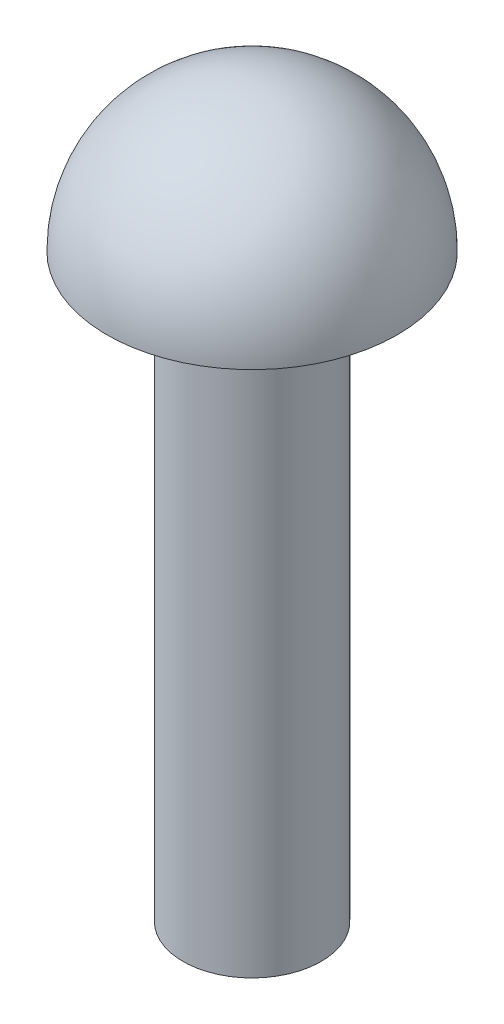
ISO-10303-21;
HEADER;
FILE_DESCRIPTION(('STEP AP214'),'2;1');
FILE_NAME('part.step','',(''),(''),'','','');
FILE_SCHEMA(('AUTOMOTIVE_DESIGN { 1 0 10303 214 1 1 1 1 }'));
ENDSEC;
DATA;
#1=APPLICATION_CONTEXT('core data for automotive mechanical design processes');
#2=APPLICATION_PROTOCOL_DEFINITION('international standard','automotive_design',2000,#1);
#3=PRODUCT_CONTEXT('',#1,'mechanical');
#4=PRODUCT('Part','Part','',(#3));
#5=PRODUCT_RELATED_PRODUCT_CATEGORY('part','',(#4));
#6=PRODUCT_DEFINITION_FORMATION('','',#4);
#7=PRODUCT_DEFINITION_CONTEXT('part definition',#1,'design');
#8=PRODUCT_DEFINITION('design','',#6,#7);
#9=PRODUCT_DEFINITION_SHAPE('','',#8);
#10=(LENGTH_UNIT() NAMED_UNIT(*) SI_UNIT(.MILLI.,.METRE.));
#11=(NAMED_UNIT(*) PLANE_ANGLE_UNIT() SI_UNIT($,.RADIAN.));
#12=(NAMED_UNIT(*) SI_UNIT($,.STERADIAN.) SOLID_ANGLE_UNIT());
#13=UNCERTAINTY_MEASURE_WITH_UNIT(LENGTH_MEASURE(1.E-05),#10,'distance_accuracy_value','');
#14=(GEOMETRIC_REPRESENTATION_CONTEXT(3) GLOBAL_UNCERTAINTY_ASSIGNED_CONTEXT((#13)) GLOBAL_UNIT_ASSIGNED_CONTEXT((#10,
#11,#12)) REPRESENTATION_CONTEXT('',''));
#15=CARTESIAN_POINT('',(0.,0.,0.));
#16=DIRECTION('',(0.,0.,1.));
#17=DIRECTION('',(1.,0.,0.));
#18=AXIS2_PLACEMENT_3D('',#15,#16,#17);
#19=CARTESIAN_POINT('',(0.,0.,0.));
#20=DIRECTION('',(0.,-1.,0.));
#21=DIRECTION('',(0.,0.,-1.));
#22=AXIS2_PLACEMENT_3D('',#19,#20,#21);
#23=PLANE('',#22);
#24=CARTESIAN_POINT('',(0.,0.,0.));
#25=DIRECTION('',(0.,-1.,0.));
#26=DIRECTION('',(0.,0.,-1.));
#27=AXIS2_PLACEMENT_3D('',#24,#25,#26);
#28=CIRCLE('',#27,4.7625);
#29=CARTESIAN_POINT('',(0.,0.,-4.7625));
#30=VERTEX_POINT('',#29);
#31=EDGE_CURVE('E10',#30,#30,#28,.T.);
#32=ORIENTED_EDGE('',*,*,#31,.T.);
#33=EDGE_LOOP('',(#32));
#34=FACE_BOUND('',#33,.T.);
#35=ADVANCED_FACE('F37',(#34),#23,.T.);
#36=CARTESIAN_POINT('',(0.,0.,0.));
#37=DIRECTION('',(0.,-1.,0.));
#38=DIRECTION('',(0.,0.,-1.));
#39=AXIS2_PLACEMENT_3D('',#36,#37,#38);
#40=CYLINDRICAL_SURFACE('',#39,4.7625);
#41=CARTESIAN_POINT('',(0.,40.,0.));
#42=DIRECTION('',(0.,-1.,0.));
#43=DIRECTION('',(0.,0.,-1.));
#44=AXIS2_PLACEMENT_3D('',#41,#42,#43);
#45=CIRCLE('',#44,4.7625);
#46=CARTESIAN_POINT('',(0.,40.,-4.7625));
#47=VERTEX_POINT('',#46);
#48=EDGE_CURVE('E44',#47,#47,#45,.T.);
#49=ORIENTED_EDGE('',*,*,#48,.T.);
#50=EDGE_LOOP('',(#49));
#51=FACE_BOUND('',#50,.T.);
#52=ORIENTED_EDGE('',*,*,#31,.F.);
#53=EDGE_LOOP('',(#52));
#54=FACE_BOUND('',#53,.T.);
#55=ADVANCED_FACE('F66',(#51,#54),#40,.T.);
#56=CARTESIAN_POINT('',(4.7625,40.,0.));
#57=DIRECTION('',(0.,-1.,0.));
#58=DIRECTION('',(0.,0.,-1.));
#59=AXIS2_PLACEMENT_3D('',#56,#57,#58);
#60=PLANE('',#59);
#61=CARTESIAN_POINT('',(0.,40.,0.));
#62=DIRECTION('',(0.,-1.,0.));
#63=DIRECTION('',(0.,0.,-1.));
#64=AXIS2_PLACEMENT_3D('',#61,#62,#63);
#65=CIRCLE('',#64,10.);
#66=CARTESIAN_POINT('',(0.,40.,-10.));
#67=VERTEX_POINT('',#66);
#68=EDGE_CURVE('E49',#67,#67,#65,.T.);
#69=ORIENTED_EDGE('',*,*,#68,.T.);
#70=EDGE_LOOP('',(#69));
#71=FACE_BOUND('',#70,.T.);
#72=ORIENTED_EDGE('',*,*,#48,.F.);
#73=EDGE_LOOP('',(#72));
#74=FACE_BOUND('',#73,.T.);
#75=ADVANCED_FACE('F57',(#71,#74),#60,.T.);
#76=CARTESIAN_POINT('',(0.,40.,0.));
#77=DIRECTION('',(0.,-1.,0.));
#78=DIRECTION('',(1.,0.,0.));
#79=AXIS2_PLACEMENT_3D('',#76,#77,#78);
#80=SPHERICAL_SURFACE('',#79,10.);
#81=ORIENTED_EDGE('',*,*,#68,.F.);
#82=EDGE_LOOP('',(#81));
#83=FACE_BOUND('',#82,.T.);
#84=ADVANCED_FACE('F60',(#83),#80,.T.);
#85=CLOSED_SHELL('',(#35,#55,#75,#84));
#86=MANIFOLD_SOLID_BREP('B2',#85);
#87=ADVANCED_BREP_SHAPE_REPRESENTATION('',(#18,#86),#14);
#88=SHAPE_DEFINITION_REPRESENTATION(#9,#87);
ENDSEC;
END-ISO-10303-21;
